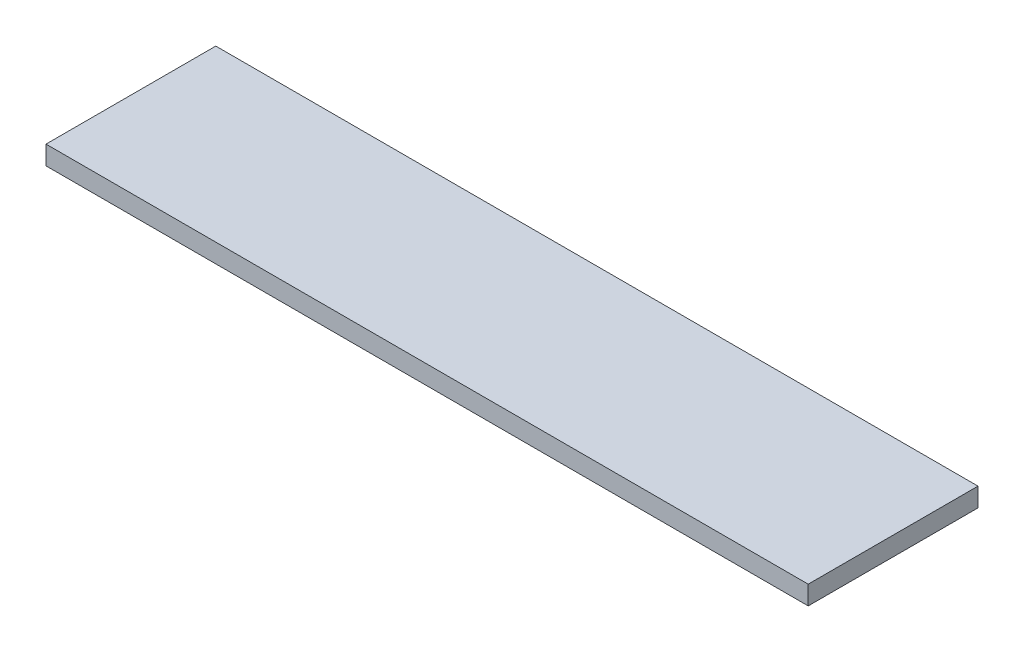
ISO-10303-21;
HEADER;
FILE_DESCRIPTION(('STEP AP214'),'2;1');
FILE_NAME('part.step','',(''),(''),'','','');
FILE_SCHEMA(('AUTOMOTIVE_DESIGN { 1 0 10303 214 1 1 1 1 }'));
ENDSEC;
DATA;
#1=APPLICATION_CONTEXT('core data for automotive mechanical design processes');
#2=APPLICATION_PROTOCOL_DEFINITION('international standard','automotive_design',2000,#1);
#3=PRODUCT_CONTEXT('',#1,'mechanical');
#4=PRODUCT('Part','Part','',(#3));
#5=PRODUCT_RELATED_PRODUCT_CATEGORY('part','',(#4));
#6=PRODUCT_DEFINITION_FORMATION('','',#4);
#7=PRODUCT_DEFINITION_CONTEXT('part definition',#1,'design');
#8=PRODUCT_DEFINITION('design','',#6,#7);
#9=PRODUCT_DEFINITION_SHAPE('','',#8);
#10=(LENGTH_UNIT() NAMED_UNIT(*) SI_UNIT(.MILLI.,.METRE.));
#11=(NAMED_UNIT(*) PLANE_ANGLE_UNIT() SI_UNIT($,.RADIAN.));
#12=(NAMED_UNIT(*) SI_UNIT($,.STERADIAN.) SOLID_ANGLE_UNIT());
#13=UNCERTAINTY_MEASURE_WITH_UNIT(LENGTH_MEASURE(1.E-05),#10,'distance_accuracy_value','');
#14=(GEOMETRIC_REPRESENTATION_CONTEXT(3) GLOBAL_UNCERTAINTY_ASSIGNED_CONTEXT((#13)) GLOBAL_UNIT_ASSIGNED_CONTEXT((#10,
#11,#12)) REPRESENTATION_CONTEXT('',''));
#15=CARTESIAN_POINT('',(0.,0.,0.));
#16=DIRECTION('',(0.,0.,1.));
#17=DIRECTION('',(1.,0.,0.));
#18=AXIS2_PLACEMENT_3D('',#15,#16,#17);
#19=CARTESIAN_POINT('',(0.,0.,45.));
#20=DIRECTION('',(0.,1.,0.));
#21=DIRECTION('',(0.,0.,1.));
#22=AXIS2_PLACEMENT_3D('',#19,#20,#21);
#23=PLANE('',#22);
#24=DIRECTION('',(1.,0.,0.));
#25=VECTOR('',#24,1.);
#26=CARTESIAN_POINT('',(0.,0.,0.));
#27=LINE('',#26,#25);
#28=CARTESIAN_POINT('',(0.,0.,0.));
#29=VERTEX_POINT('',#28);
#30=CARTESIAN_POINT('',(202.,0.,0.));
#31=VERTEX_POINT('',#30);
#32=EDGE_CURVE('E98',#29,#31,#27,.T.);
#33=ORIENTED_EDGE('',*,*,#32,.T.);
#34=DIRECTION('',(0.,0.,-1.));
#35=VECTOR('',#34,1.);
#36=CARTESIAN_POINT('',(202.,0.,45.));
#37=LINE('',#36,#35);
#38=CARTESIAN_POINT('',(202.,0.,45.));
#39=VERTEX_POINT('',#38);
#40=EDGE_CURVE('E11',#39,#31,#37,.T.);
#41=ORIENTED_EDGE('',*,*,#40,.F.);
#42=DIRECTION('',(1.,0.,0.));
#43=VECTOR('',#42,1.);
#44=CARTESIAN_POINT('',(0.,0.,45.));
#45=LINE('',#44,#43);
#46=CARTESIAN_POINT('',(0.,0.,45.));
#47=VERTEX_POINT('',#46);
#48=EDGE_CURVE('E84',#47,#39,#45,.T.);
#49=ORIENTED_EDGE('',*,*,#48,.F.);
#50=DIRECTION('',(0.,0.,-1.));
#51=VECTOR('',#50,1.);
#52=CARTESIAN_POINT('',(0.,0.,45.));
#53=LINE('',#52,#51);
#54=EDGE_CURVE('E51',#47,#29,#53,.T.);
#55=ORIENTED_EDGE('',*,*,#54,.T.);
#56=EDGE_LOOP('',(#33,#41,#49,#55));
#57=FACE_BOUND('',#56,.T.);
#58=ADVANCED_FACE('F35',(#57),#23,.F.);
#59=CARTESIAN_POINT('',(202.,0.,45.));
#60=DIRECTION('',(-1.,0.,0.));
#61=DIRECTION('',(0.,0.,1.));
#62=AXIS2_PLACEMENT_3D('',#59,#60,#61);
#63=PLANE('',#62);
#64=DIRECTION('',(0.,1.,0.));
#65=VECTOR('',#64,1.);
#66=CARTESIAN_POINT('',(202.,0.,0.));
#67=LINE('',#66,#65);
#68=CARTESIAN_POINT('',(202.,5.,0.));
#69=VERTEX_POINT('',#68);
#70=EDGE_CURVE('E89',#31,#69,#67,.T.);
#71=ORIENTED_EDGE('',*,*,#70,.T.);
#72=DIRECTION('',(0.,0.,-1.));
#73=VECTOR('',#72,1.);
#74=CARTESIAN_POINT('',(202.,5.,45.));
#75=LINE('',#74,#73);
#76=CARTESIAN_POINT('',(202.,5.,45.));
#77=VERTEX_POINT('',#76);
#78=EDGE_CURVE('E43',#77,#69,#75,.T.);
#79=ORIENTED_EDGE('',*,*,#78,.F.);
#80=DIRECTION('',(0.,1.,0.));
#81=VECTOR('',#80,1.);
#82=CARTESIAN_POINT('',(202.,0.,45.));
#83=LINE('',#82,#81);
#84=EDGE_CURVE('E76',#39,#77,#83,.T.);
#85=ORIENTED_EDGE('',*,*,#84,.F.);
#86=ORIENTED_EDGE('',*,*,#40,.T.);
#87=EDGE_LOOP('',(#71,#79,#85,#86));
#88=FACE_BOUND('',#87,.T.);
#89=ADVANCED_FACE('F88',(#88),#63,.F.);
#90=CARTESIAN_POINT('',(0.,5.,45.));
#91=DIRECTION('',(0.,1.,0.));
#92=DIRECTION('',(0.,0.,1.));
#93=AXIS2_PLACEMENT_3D('',#90,#91,#92);
#94=PLANE('',#93);
#95=DIRECTION('',(1.,0.,0.));
#96=VECTOR('',#95,1.);
#97=CARTESIAN_POINT('',(0.,5.,0.));
#98=LINE('',#97,#96);
#99=CARTESIAN_POINT('',(0.,5.,0.));
#100=VERTEX_POINT('',#99);
#101=EDGE_CURVE('E101',#100,#69,#98,.T.);
#102=ORIENTED_EDGE('',*,*,#101,.F.);
#103=DIRECTION('',(0.,0.,-1.));
#104=VECTOR('',#103,1.);
#105=CARTESIAN_POINT('',(0.,5.,45.));
#106=LINE('',#105,#104);
#107=CARTESIAN_POINT('',(0.,5.,45.));
#108=VERTEX_POINT('',#107);
#109=EDGE_CURVE('E65',#108,#100,#106,.T.);
#110=ORIENTED_EDGE('',*,*,#109,.F.);
#111=DIRECTION('',(1.,0.,0.));
#112=VECTOR('',#111,1.);
#113=CARTESIAN_POINT('',(0.,5.,45.));
#114=LINE('',#113,#112);
#115=EDGE_CURVE('E83',#108,#77,#114,.T.);
#116=ORIENTED_EDGE('',*,*,#115,.T.);
#117=ORIENTED_EDGE('',*,*,#78,.T.);
#118=EDGE_LOOP('',(#102,#110,#116,#117));
#119=FACE_BOUND('',#118,.T.);
#120=ADVANCED_FACE('F92',(#119),#94,.T.);
#121=CARTESIAN_POINT('',(0.,0.,45.));
#122=DIRECTION('',(-1.,0.,0.));
#123=DIRECTION('',(0.,0.,1.));
#124=AXIS2_PLACEMENT_3D('',#121,#122,#123);
#125=PLANE('',#124);
#126=DIRECTION('',(0.,1.,0.));
#127=VECTOR('',#126,1.);
#128=CARTESIAN_POINT('',(0.,0.,0.));
#129=LINE('',#128,#127);
#130=EDGE_CURVE('E103',#29,#100,#129,.T.);
#131=ORIENTED_EDGE('',*,*,#130,.F.);
#132=ORIENTED_EDGE('',*,*,#54,.F.);
#133=DIRECTION('',(0.,1.,0.));
#134=VECTOR('',#133,1.);
#135=CARTESIAN_POINT('',(0.,0.,45.));
#136=LINE('',#135,#134);
#137=EDGE_CURVE('E93',#47,#108,#136,.T.);
#138=ORIENTED_EDGE('',*,*,#137,.T.);
#139=ORIENTED_EDGE('',*,*,#109,.T.);
#140=EDGE_LOOP('',(#131,#132,#138,#139));
#141=FACE_BOUND('',#140,.T.);
#142=ADVANCED_FACE('F109',(#141),#125,.T.);
#143=CARTESIAN_POINT('',(0.,0.,45.));
#144=DIRECTION('',(0.,0.,1.));
#145=DIRECTION('',(1.,0.,0.));
#146=AXIS2_PLACEMENT_3D('',#143,#144,#145);
#147=PLANE('',#146);
#148=ORIENTED_EDGE('',*,*,#48,.T.);
#149=ORIENTED_EDGE('',*,*,#84,.T.);
#150=ORIENTED_EDGE('',*,*,#115,.F.);
#151=ORIENTED_EDGE('',*,*,#137,.F.);
#152=EDGE_LOOP('',(#148,#149,#150,#151));
#153=FACE_BOUND('',#152,.T.);
#154=ADVANCED_FACE('F80',(#153),#147,.T.);
#155=CARTESIAN_POINT('',(0.,0.,0.));
#156=DIRECTION('',(0.,0.,1.));
#157=DIRECTION('',(1.,0.,0.));
#158=AXIS2_PLACEMENT_3D('',#155,#156,#157);
#159=PLANE('',#158);
#160=ORIENTED_EDGE('',*,*,#32,.F.);
#161=ORIENTED_EDGE('',*,*,#130,.T.);
#162=ORIENTED_EDGE('',*,*,#101,.T.);
#163=ORIENTED_EDGE('',*,*,#70,.F.);
#164=EDGE_LOOP('',(#160,#161,#162,#163));
#165=FACE_BOUND('',#164,.T.);
#166=ADVANCED_FACE('F108',(#165),#159,.F.);
#167=CLOSED_SHELL('',(#58,#89,#120,#142,#154,#166));
#168=MANIFOLD_SOLID_BREP('B2',#167);
#169=ADVANCED_BREP_SHAPE_REPRESENTATION('',(#18,#168),#14);
#170=SHAPE_DEFINITION_REPRESENTATION(#9,#169);
ENDSEC;
END-ISO-10303-21;
